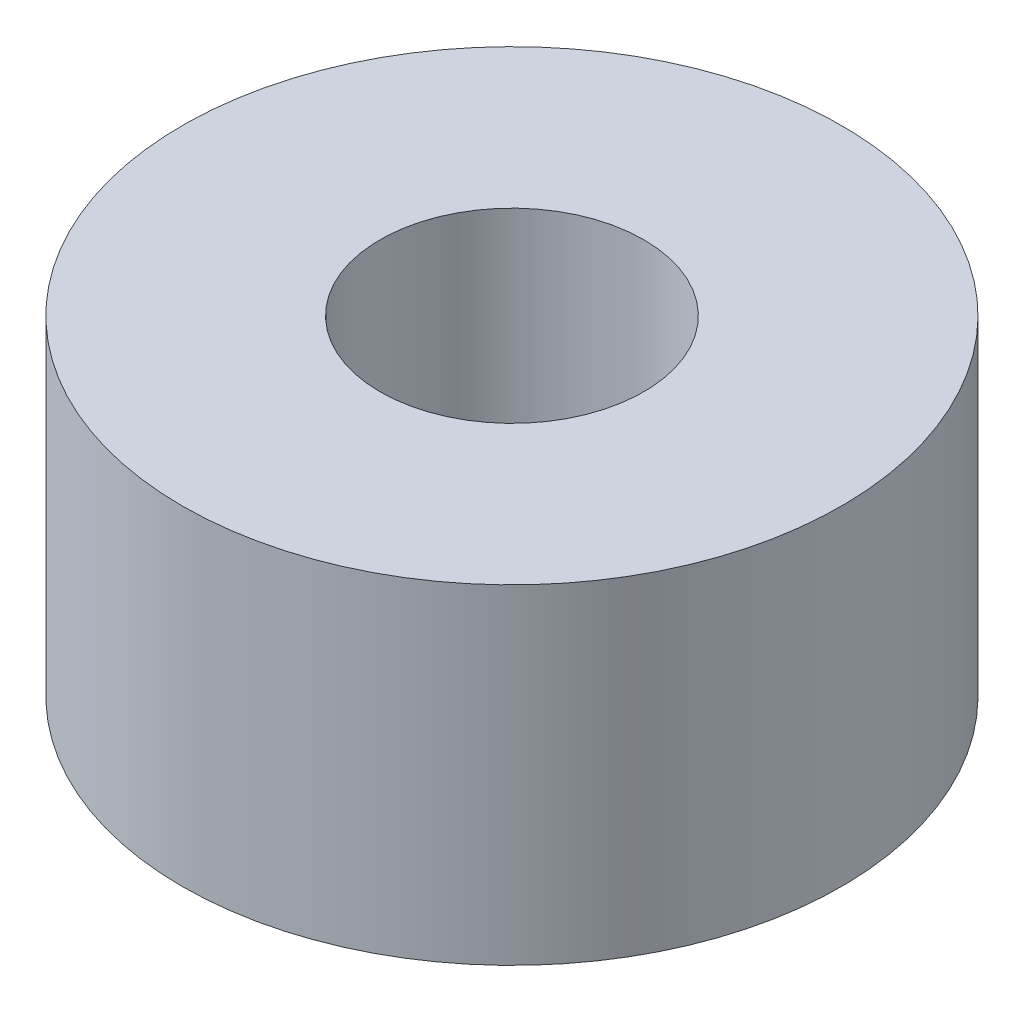
ISO-10303-21;
HEADER;
FILE_DESCRIPTION(('STEP AP214'),'2;1');
FILE_NAME('part.step','',(''),(''),'','','');
FILE_SCHEMA(('AUTOMOTIVE_DESIGN { 1 0 10303 214 1 1 1 1 }'));
ENDSEC;
DATA;
#1=APPLICATION_CONTEXT('core data for automotive mechanical design processes');
#2=APPLICATION_PROTOCOL_DEFINITION('international standard','automotive_design',2000,#1);
#3=PRODUCT_CONTEXT('',#1,'mechanical');
#4=PRODUCT('Part','Part','',(#3));
#5=PRODUCT_RELATED_PRODUCT_CATEGORY('part','',(#4));
#6=PRODUCT_DEFINITION_FORMATION('','',#4);
#7=PRODUCT_DEFINITION_CONTEXT('part definition',#1,'design');
#8=PRODUCT_DEFINITION('design','',#6,#7);
#9=PRODUCT_DEFINITION_SHAPE('','',#8);
#10=(LENGTH_UNIT() NAMED_UNIT(*) SI_UNIT(.MILLI.,.METRE.));
#11=(NAMED_UNIT(*) PLANE_ANGLE_UNIT() SI_UNIT($,.RADIAN.));
#12=(NAMED_UNIT(*) SI_UNIT($,.STERADIAN.) SOLID_ANGLE_UNIT());
#13=UNCERTAINTY_MEASURE_WITH_UNIT(LENGTH_MEASURE(1.E-05),#10,'distance_accuracy_value','');
#14=(GEOMETRIC_REPRESENTATION_CONTEXT(3) GLOBAL_UNCERTAINTY_ASSIGNED_CONTEXT((#13)) GLOBAL_UNIT_ASSIGNED_CONTEXT((#10,
#11,#12)) REPRESENTATION_CONTEXT('',''));
#15=CARTESIAN_POINT('',(0.,0.,0.));
#16=DIRECTION('',(0.,0.,1.));
#17=DIRECTION('',(1.,0.,0.));
#18=AXIS2_PLACEMENT_3D('',#15,#16,#17);
#19=CARTESIAN_POINT('',(0.,2.5,0.));
#20=DIRECTION('',(0.,1.,0.));
#21=DIRECTION('',(0.,0.,1.));
#22=AXIS2_PLACEMENT_3D('',#19,#20,#21);
#23=PLANE('',#22);
#24=CARTESIAN_POINT('',(0.,2.5,0.));
#25=DIRECTION('',(0.,1.,0.));
#26=DIRECTION('',(0.,0.,1.));
#27=AXIS2_PLACEMENT_3D('',#24,#25,#26);
#28=CIRCLE('',#27,2.5);
#29=CARTESIAN_POINT('',(0.,2.5,2.5));
#30=VERTEX_POINT('',#29);
#31=EDGE_CURVE('E10',#30,#30,#28,.T.);
#32=ORIENTED_EDGE('',*,*,#31,.T.);
#33=EDGE_LOOP('',(#32));
#34=FACE_BOUND('',#33,.T.);
#35=CARTESIAN_POINT('',(0.,2.5,0.));
#36=DIRECTION('',(0.,1.,0.));
#37=DIRECTION('',(0.,0.,1.));
#38=AXIS2_PLACEMENT_3D('',#35,#36,#37);
#39=CIRCLE('',#38,1.);
#40=CARTESIAN_POINT('',(0.,2.5,1.));
#41=VERTEX_POINT('',#40);
#42=EDGE_CURVE('E43',#41,#41,#39,.T.);
#43=ORIENTED_EDGE('',*,*,#42,.F.);
#44=EDGE_LOOP('',(#43));
#45=FACE_BOUND('',#44,.T.);
#46=ADVANCED_FACE('F32',(#34,#45),#23,.T.);
#47=CARTESIAN_POINT('',(0.,0.,0.));
#48=DIRECTION('',(0.,1.,0.));
#49=DIRECTION('',(0.,0.,1.));
#50=AXIS2_PLACEMENT_3D('',#47,#48,#49);
#51=PLANE('',#50);
#52=CARTESIAN_POINT('',(0.,0.,0.));
#53=DIRECTION('',(0.,1.,0.));
#54=DIRECTION('',(0.,0.,1.));
#55=AXIS2_PLACEMENT_3D('',#52,#53,#54);
#56=CIRCLE('',#55,2.5);
#57=CARTESIAN_POINT('',(0.,0.,2.5));
#58=VERTEX_POINT('',#57);
#59=EDGE_CURVE('E36',#58,#58,#56,.T.);
#60=ORIENTED_EDGE('',*,*,#59,.F.);
#61=EDGE_LOOP('',(#60));
#62=FACE_BOUND('',#61,.T.);
#63=CARTESIAN_POINT('',(0.,0.,0.));
#64=DIRECTION('',(0.,1.,0.));
#65=DIRECTION('',(0.,0.,1.));
#66=AXIS2_PLACEMENT_3D('',#63,#64,#65);
#67=CIRCLE('',#66,1.);
#68=CARTESIAN_POINT('',(0.,0.,1.));
#69=VERTEX_POINT('',#68);
#70=EDGE_CURVE('E45',#69,#69,#67,.T.);
#71=ORIENTED_EDGE('',*,*,#70,.T.);
#72=EDGE_LOOP('',(#71));
#73=FACE_BOUND('',#72,.T.);
#74=ADVANCED_FACE('F55',(#62,#73),#51,.F.);
#75=CARTESIAN_POINT('',(0.,2.5,0.));
#76=DIRECTION('',(0.,-1.,0.));
#77=DIRECTION('',(0.,0.,-1.));
#78=AXIS2_PLACEMENT_3D('',#75,#76,#77);
#79=CYLINDRICAL_SURFACE('',#78,2.5);
#80=ORIENTED_EDGE('',*,*,#31,.F.);
#81=EDGE_LOOP('',(#80));
#82=FACE_BOUND('',#81,.T.);
#83=ORIENTED_EDGE('',*,*,#59,.T.);
#84=EDGE_LOOP('',(#83));
#85=FACE_BOUND('',#84,.T.);
#86=ADVANCED_FACE('F34',(#82,#85),#79,.T.);
#87=CARTESIAN_POINT('',(0.,2.5,0.));
#88=DIRECTION('',(0.,-1.,0.));
#89=DIRECTION('',(0.,0.,-1.));
#90=AXIS2_PLACEMENT_3D('',#87,#88,#89);
#91=CYLINDRICAL_SURFACE('',#90,1.);
#92=ORIENTED_EDGE('',*,*,#42,.T.);
#93=EDGE_LOOP('',(#92));
#94=FACE_BOUND('',#93,.T.);
#95=ORIENTED_EDGE('',*,*,#70,.F.);
#96=EDGE_LOOP('',(#95));
#97=FACE_BOUND('',#96,.T.);
#98=ADVANCED_FACE('F51',(#94,#97),#91,.F.);
#99=CLOSED_SHELL('',(#46,#74,#86,#98));
#100=MANIFOLD_SOLID_BREP('B2',#99);
#101=ADVANCED_BREP_SHAPE_REPRESENTATION('',(#18,#100),#14);
#102=SHAPE_DEFINITION_REPRESENTATION(#9,#101);
ENDSEC;
END-ISO-10303-21;
